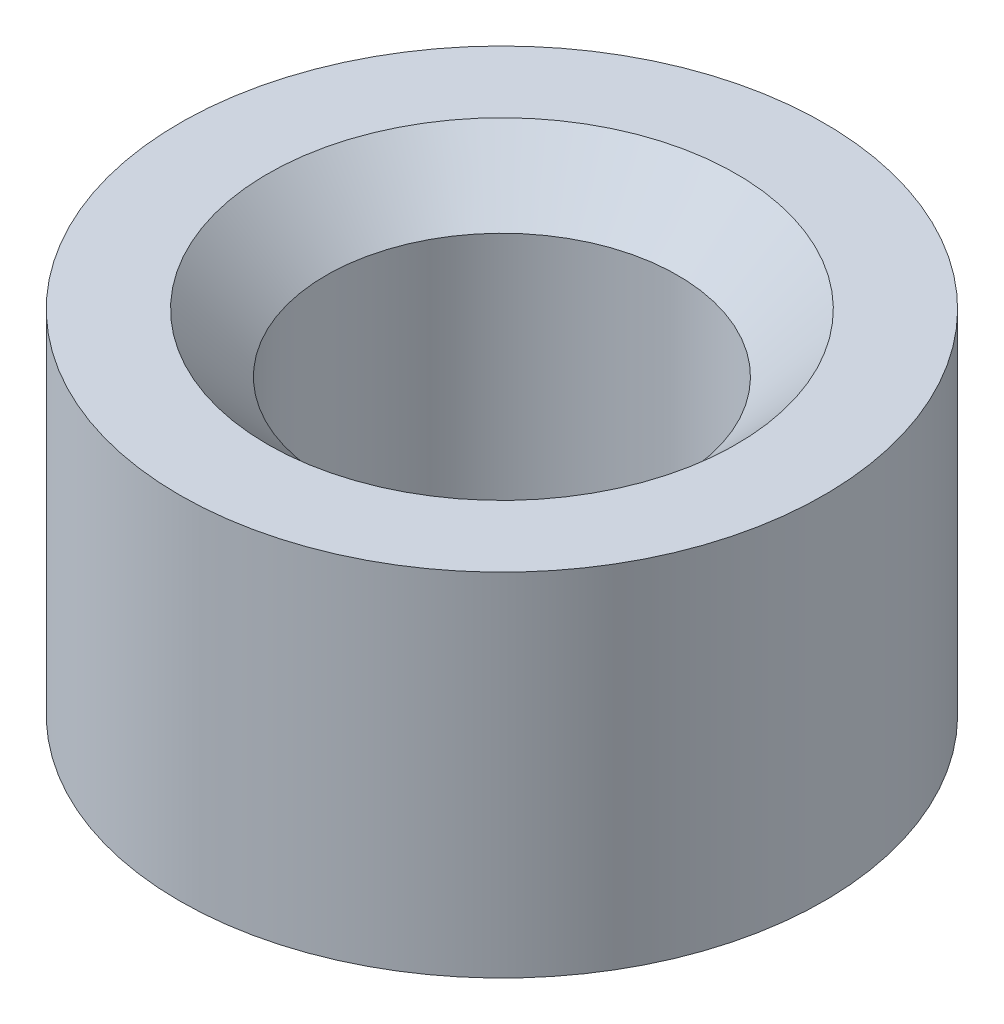
ISO-10303-21;
HEADER;
FILE_DESCRIPTION(('STEP AP214'),'2;1');
FILE_NAME('part.step','',(''),(''),'','','');
FILE_SCHEMA(('AUTOMOTIVE_DESIGN { 1 0 10303 214 1 1 1 1 }'));
ENDSEC;
DATA;
#1=APPLICATION_CONTEXT('core data for automotive mechanical design processes');
#2=APPLICATION_PROTOCOL_DEFINITION('international standard','automotive_design',2000,#1);
#3=PRODUCT_CONTEXT('',#1,'mechanical');
#4=PRODUCT('Part','Part','',(#3));
#5=PRODUCT_RELATED_PRODUCT_CATEGORY('part','',(#4));
#6=PRODUCT_DEFINITION_FORMATION('','',#4);
#7=PRODUCT_DEFINITION_CONTEXT('part definition',#1,'design');
#8=PRODUCT_DEFINITION('design','',#6,#7);
#9=PRODUCT_DEFINITION_SHAPE('','',#8);
#10=(LENGTH_UNIT() NAMED_UNIT(*) SI_UNIT(.MILLI.,.METRE.));
#11=(NAMED_UNIT(*) PLANE_ANGLE_UNIT() SI_UNIT($,.RADIAN.));
#12=(NAMED_UNIT(*) SI_UNIT($,.STERADIAN.) SOLID_ANGLE_UNIT());
#13=UNCERTAINTY_MEASURE_WITH_UNIT(LENGTH_MEASURE(1.E-05),#10,'distance_accuracy_value','');
#14=(GEOMETRIC_REPRESENTATION_CONTEXT(3) GLOBAL_UNCERTAINTY_ASSIGNED_CONTEXT((#13)) GLOBAL_UNIT_ASSIGNED_CONTEXT((#10,
#11,#12)) REPRESENTATION_CONTEXT('',''));
#15=CARTESIAN_POINT('',(0.,0.,0.));
#16=DIRECTION('',(0.,0.,1.));
#17=DIRECTION('',(1.,0.,0.));
#18=AXIS2_PLACEMENT_3D('',#15,#16,#17);
#19=CARTESIAN_POINT('',(0.,3.,0.));
#20=DIRECTION('',(0.,1.,0.));
#21=DIRECTION('',(0.,0.,1.));
#22=AXIS2_PLACEMENT_3D('',#19,#20,#21);
#23=PLANE('',#22);
#24=CARTESIAN_POINT('',(0.,3.,0.));
#25=DIRECTION('',(0.,1.,0.));
#26=DIRECTION('',(0.,0.,1.));
#27=AXIS2_PLACEMENT_3D('',#24,#25,#26);
#28=CIRCLE('',#27,2.);
#29=CARTESIAN_POINT('',(0.,3.,2.));
#30=VERTEX_POINT('',#29);
#31=EDGE_CURVE('E10',#30,#30,#28,.F.);
#32=ORIENTED_EDGE('',*,*,#31,.T.);
#33=EDGE_LOOP('',(#32));
#34=FACE_BOUND('',#33,.T.);
#35=CARTESIAN_POINT('',(0.,3.,0.));
#36=DIRECTION('',(0.,1.,0.));
#37=DIRECTION('',(0.,0.,1.));
#38=AXIS2_PLACEMENT_3D('',#35,#36,#37);
#39=CIRCLE('',#38,2.75);
#40=CARTESIAN_POINT('',(0.,3.,2.75));
#41=VERTEX_POINT('',#40);
#42=EDGE_CURVE('E70',#41,#41,#39,.T.);
#43=ORIENTED_EDGE('',*,*,#42,.T.);
#44=EDGE_LOOP('',(#43));
#45=FACE_BOUND('',#44,.T.);
#46=ADVANCED_FACE('F45',(#34,#45),#23,.T.);
#47=CARTESIAN_POINT('',(0.,0.,0.));
#48=DIRECTION('',(0.,1.,0.));
#49=DIRECTION('',(0.,0.,1.));
#50=AXIS2_PLACEMENT_3D('',#47,#48,#49);
#51=PLANE('',#50);
#52=CARTESIAN_POINT('',(0.,0.,0.));
#53=DIRECTION('',(0.,1.,0.));
#54=DIRECTION('',(0.,0.,1.));
#55=AXIS2_PLACEMENT_3D('',#52,#53,#54);
#56=CIRCLE('',#55,2.);
#57=CARTESIAN_POINT('',(0.,0.,2.));
#58=VERTEX_POINT('',#57);
#59=EDGE_CURVE('E64',#58,#58,#56,.T.);
#60=ORIENTED_EDGE('',*,*,#59,.T.);
#61=EDGE_LOOP('',(#60));
#62=FACE_BOUND('',#61,.T.);
#63=CARTESIAN_POINT('',(0.,0.,0.));
#64=DIRECTION('',(0.,1.,0.));
#65=DIRECTION('',(0.,0.,1.));
#66=AXIS2_PLACEMENT_3D('',#63,#64,#65);
#67=CIRCLE('',#66,2.75);
#68=CARTESIAN_POINT('',(0.,0.,2.75));
#69=VERTEX_POINT('',#68);
#70=EDGE_CURVE('E71',#69,#69,#67,.T.);
#71=ORIENTED_EDGE('',*,*,#70,.F.);
#72=EDGE_LOOP('',(#71));
#73=FACE_BOUND('',#72,.T.);
#74=ADVANCED_FACE('F84',(#62,#73),#51,.F.);
#75=CARTESIAN_POINT('',(0.,3.,0.));
#76=DIRECTION('',(0.,-1.,0.));
#77=DIRECTION('',(0.,0.,-1.));
#78=AXIS2_PLACEMENT_3D('',#75,#76,#77);
#79=CYLINDRICAL_SURFACE('',#78,2.75);
#80=ORIENTED_EDGE('',*,*,#42,.F.);
#81=EDGE_LOOP('',(#80));
#82=FACE_BOUND('',#81,.T.);
#83=ORIENTED_EDGE('',*,*,#70,.T.);
#84=EDGE_LOOP('',(#83));
#85=FACE_BOUND('',#84,.T.);
#86=ADVANCED_FACE('F80',(#82,#85),#79,.T.);
#87=CARTESIAN_POINT('',(0.,3.,0.));
#88=DIRECTION('',(0.,-1.,0.));
#89=DIRECTION('',(0.,0.,-1.));
#90=AXIS2_PLACEMENT_3D('',#87,#88,#89);
#91=CYLINDRICAL_SURFACE('',#90,1.5);
#92=CARTESIAN_POINT('',(0.,0.500000000000001,0.));
#93=DIRECTION('',(0.,1.,0.));
#94=DIRECTION('',(0.,0.,1.));
#95=AXIS2_PLACEMENT_3D('',#92,#93,#94);
#96=CIRCLE('',#95,1.5);
#97=CARTESIAN_POINT('',(0.,0.500000000000001,1.5));
#98=VERTEX_POINT('',#97);
#99=EDGE_CURVE('E54',#98,#98,#96,.F.);
#100=ORIENTED_EDGE('',*,*,#99,.T.);
#101=EDGE_LOOP('',(#100));
#102=FACE_BOUND('',#101,.T.);
#103=CARTESIAN_POINT('',(0.,2.5,0.));
#104=DIRECTION('',(0.,1.,0.));
#105=DIRECTION('',(0.,0.,1.));
#106=AXIS2_PLACEMENT_3D('',#103,#104,#105);
#107=CIRCLE('',#106,1.5);
#108=CARTESIAN_POINT('',(0.,2.5,1.5));
#109=VERTEX_POINT('',#108);
#110=EDGE_CURVE('E59',#109,#109,#107,.T.);
#111=ORIENTED_EDGE('',*,*,#110,.T.);
#112=EDGE_LOOP('',(#111));
#113=FACE_BOUND('',#112,.T.);
#114=ADVANCED_FACE('F83',(#102,#113),#91,.F.);
#115=CARTESIAN_POINT('',(0.,0.,0.));
#116=DIRECTION('',(0.,-1.,0.));
#117=DIRECTION('',(0.,0.,-1.));
#118=AXIS2_PLACEMENT_3D('',#115,#116,#117);
#119=CONICAL_SURFACE('',#118,2.,0.785398163397446);
#120=ORIENTED_EDGE('',*,*,#99,.F.);
#121=EDGE_LOOP('',(#120));
#122=FACE_BOUND('',#121,.T.);
#123=ORIENTED_EDGE('',*,*,#59,.F.);
#124=EDGE_LOOP('',(#123));
#125=FACE_BOUND('',#124,.T.);
#126=ADVANCED_FACE('F98',(#122,#125),#119,.F.);
#127=CARTESIAN_POINT('',(0.,2.5,0.));
#128=DIRECTION('',(0.,1.,0.));
#129=DIRECTION('',(0.,0.,1.));
#130=AXIS2_PLACEMENT_3D('',#127,#128,#129);
#131=CONICAL_SURFACE('',#130,1.5,0.785398163397451);
#132=ORIENTED_EDGE('',*,*,#31,.F.);
#133=EDGE_LOOP('',(#132));
#134=FACE_BOUND('',#133,.T.);
#135=ORIENTED_EDGE('',*,*,#110,.F.);
#136=EDGE_LOOP('',(#135));
#137=FACE_BOUND('',#136,.T.);
#138=ADVANCED_FACE('F48',(#134,#137),#131,.F.);
#139=CLOSED_SHELL('',(#46,#74,#86,#114,#126,#138));
#140=MANIFOLD_SOLID_BREP('B2',#139);
#141=ADVANCED_BREP_SHAPE_REPRESENTATION('',(#18,#140),#14);
#142=SHAPE_DEFINITION_REPRESENTATION(#9,#141);
ENDSEC;
END-ISO-10303-21;
